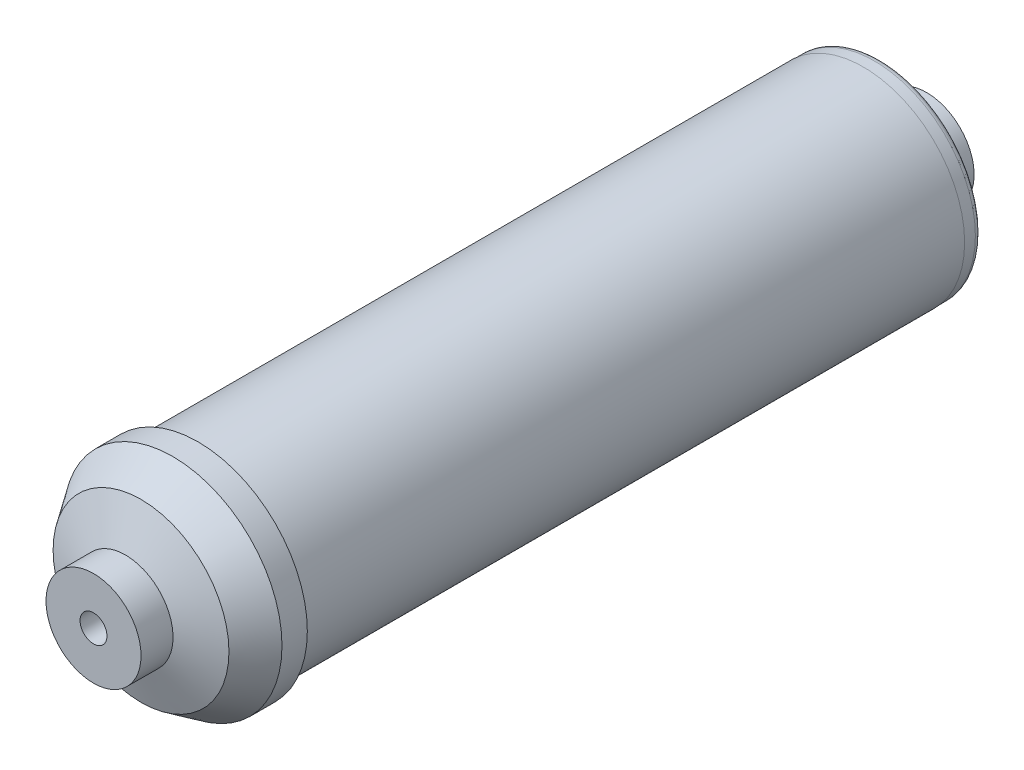
ISO-10303-21;
HEADER;
FILE_DESCRIPTION(('STEP AP214'),'2;1');
FILE_NAME('part.step','',(''),(''),'','','');
FILE_SCHEMA(('AUTOMOTIVE_DESIGN { 1 0 10303 214 1 1 1 1 }'));
ENDSEC;
DATA;
#1=APPLICATION_CONTEXT('core data for automotive mechanical design processes');
#2=APPLICATION_PROTOCOL_DEFINITION('international standard','automotive_design',2000,#1);
#3=PRODUCT_CONTEXT('',#1,'mechanical');
#4=PRODUCT('Part','Part','',(#3));
#5=PRODUCT_RELATED_PRODUCT_CATEGORY('part','',(#4));
#6=PRODUCT_DEFINITION_FORMATION('','',#4);
#7=PRODUCT_DEFINITION_CONTEXT('part definition',#1,'design');
#8=PRODUCT_DEFINITION('design','',#6,#7);
#9=PRODUCT_DEFINITION_SHAPE('','',#8);
#10=(LENGTH_UNIT() NAMED_UNIT(*) SI_UNIT(.MILLI.,.METRE.));
#11=(NAMED_UNIT(*) PLANE_ANGLE_UNIT() SI_UNIT($,.RADIAN.));
#12=(NAMED_UNIT(*) SI_UNIT($,.STERADIAN.) SOLID_ANGLE_UNIT());
#13=UNCERTAINTY_MEASURE_WITH_UNIT(LENGTH_MEASURE(1.E-05),#10,'distance_accuracy_value','');
#14=(GEOMETRIC_REPRESENTATION_CONTEXT(3) GLOBAL_UNCERTAINTY_ASSIGNED_CONTEXT((#13)) GLOBAL_UNIT_ASSIGNED_CONTEXT((#10,
#11,#12)) REPRESENTATION_CONTEXT('',''));
#15=CARTESIAN_POINT('',(0.,0.,0.));
#16=DIRECTION('',(0.,0.,1.));
#17=DIRECTION('',(1.,0.,0.));
#18=AXIS2_PLACEMENT_3D('',#15,#16,#17);
#19=CARTESIAN_POINT('',(0.,0.,0.));
#20=DIRECTION('',(0.,0.,1.));
#21=DIRECTION('',(1.,0.,0.));
#22=AXIS2_PLACEMENT_3D('',#19,#20,#21);
#23=PLANE('',#22);
#24=CARTESIAN_POINT('',(0.,0.,0.));
#25=DIRECTION('',(0.,0.,1.));
#26=DIRECTION('',(1.,0.,0.));
#27=AXIS2_PLACEMENT_3D('',#24,#25,#26);
#28=CIRCLE('',#27,32.);
#29=CARTESIAN_POINT('',(32.,0.,0.));
#30=VERTEX_POINT('',#29);
#31=EDGE_CURVE('E63',#30,#30,#28,.T.);
#32=ORIENTED_EDGE('',*,*,#31,.F.);
#33=EDGE_LOOP('',(#32));
#34=FACE_BOUND('',#33,.T.);
#35=CARTESIAN_POINT('',(0.,0.,0.));
#36=DIRECTION('',(0.,0.,1.));
#37=DIRECTION('',(1.,0.,0.));
#38=AXIS2_PLACEMENT_3D('',#35,#36,#37);
#39=CIRCLE('',#38,31.9);
#40=CARTESIAN_POINT('',(31.9,0.,0.));
#41=VERTEX_POINT('',#40);
#42=EDGE_CURVE('E48',#41,#41,#39,.F.);
#43=ORIENTED_EDGE('',*,*,#42,.F.);
#44=EDGE_LOOP('',(#43));
#45=FACE_BOUND('',#44,.T.);
#46=ADVANCED_FACE('F33',(#34,#45),#23,.F.);
#47=CARTESIAN_POINT('',(0.,0.,210.));
#48=DIRECTION('',(0.,0.,-1.));
#49=DIRECTION('',(-1.,0.,0.));
#50=AXIS2_PLACEMENT_3D('',#47,#48,#49);
#51=CYLINDRICAL_SURFACE('',#50,32.);
#52=CARTESIAN_POINT('',(0.,0.,210.));
#53=DIRECTION('',(0.,0.,1.));
#54=DIRECTION('',(1.,0.,0.));
#55=AXIS2_PLACEMENT_3D('',#52,#53,#54);
#56=CIRCLE('',#55,32.);
#57=CARTESIAN_POINT('',(32.,0.,210.));
#58=VERTEX_POINT('',#57);
#59=EDGE_CURVE('E62',#58,#58,#56,.T.);
#60=ORIENTED_EDGE('',*,*,#59,.F.);
#61=EDGE_LOOP('',(#60));
#62=FACE_BOUND('',#61,.T.);
#63=ORIENTED_EDGE('',*,*,#31,.T.);
#64=EDGE_LOOP('',(#63));
#65=FACE_BOUND('',#64,.T.);
#66=ADVANCED_FACE('F110',(#62,#65),#51,.T.);
#67=CARTESIAN_POINT('',(0.,0.,210.));
#68=DIRECTION('',(0.,0.,1.));
#69=DIRECTION('',(1.,0.,0.));
#70=AXIS2_PLACEMENT_3D('',#67,#68,#69);
#71=PLANE('',#70);
#72=CARTESIAN_POINT('',(0.,0.,210.));
#73=DIRECTION('',(0.,0.,1.));
#74=DIRECTION('',(1.,0.,0.));
#75=AXIS2_PLACEMENT_3D('',#72,#73,#74);
#76=CIRCLE('',#75,34.5);
#77=CARTESIAN_POINT('',(34.5,0.,210.));
#78=VERTEX_POINT('',#77);
#79=EDGE_CURVE('E66',#78,#78,#76,.T.);
#80=ORIENTED_EDGE('',*,*,#79,.F.);
#81=EDGE_LOOP('',(#80));
#82=FACE_BOUND('',#81,.T.);
#83=ORIENTED_EDGE('',*,*,#59,.T.);
#84=EDGE_LOOP('',(#83));
#85=FACE_BOUND('',#84,.T.);
#86=ADVANCED_FACE('F116',(#82,#85),#71,.F.);
#87=CARTESIAN_POINT('',(0.,0.,228.));
#88=DIRECTION('',(0.,0.,-1.));
#89=DIRECTION('',(-1.,0.,0.));
#90=AXIS2_PLACEMENT_3D('',#87,#88,#89);
#91=CYLINDRICAL_SURFACE('',#90,34.5);
#92=CARTESIAN_POINT('',(0.,0.,218.));
#93=DIRECTION('',(0.,0.,1.));
#94=DIRECTION('',(1.,0.,0.));
#95=AXIS2_PLACEMENT_3D('',#92,#93,#94);
#96=CIRCLE('',#95,34.5);
#97=CARTESIAN_POINT('',(34.5,0.,218.));
#98=VERTEX_POINT('',#97);
#99=EDGE_CURVE('E56',#98,#98,#96,.F.);
#100=ORIENTED_EDGE('',*,*,#99,.T.);
#101=EDGE_LOOP('',(#100));
#102=FACE_BOUND('',#101,.T.);
#103=ORIENTED_EDGE('',*,*,#79,.T.);
#104=EDGE_LOOP('',(#103));
#105=FACE_BOUND('',#104,.T.);
#106=ADVANCED_FACE('F122',(#102,#105),#91,.T.);
#107=CARTESIAN_POINT('',(0.,0.,228.));
#108=DIRECTION('',(0.,0.,-1.));
#109=DIRECTION('',(-1.,0.,0.));
#110=AXIS2_PLACEMENT_3D('',#107,#108,#109);
#111=CONICAL_SURFACE('',#110,27.7549148315757,0.593411945678069);
#112=ORIENTED_EDGE('',*,*,#99,.F.);
#113=EDGE_LOOP('',(#112));
#114=FACE_BOUND('',#113,.T.);
#115=CARTESIAN_POINT('',(0.,0.,228.));
#116=DIRECTION('',(0.,0.,1.));
#117=DIRECTION('',(1.,0.,0.));
#118=AXIS2_PLACEMENT_3D('',#115,#116,#117);
#119=CIRCLE('',#118,27.7549148315757);
#120=CARTESIAN_POINT('',(27.7549148315757,0.,228.));
#121=VERTEX_POINT('',#120);
#122=EDGE_CURVE('E59',#121,#121,#119,.T.);
#123=ORIENTED_EDGE('',*,*,#122,.F.);
#124=EDGE_LOOP('',(#123));
#125=FACE_BOUND('',#124,.T.);
#126=ADVANCED_FACE('F125',(#114,#125),#111,.T.);
#127=CARTESIAN_POINT('',(0.,0.,243.));
#128=DIRECTION('',(0.,0.,-1.));
#129=DIRECTION('',(-1.,0.,0.));
#130=AXIS2_PLACEMENT_3D('',#127,#128,#129);
#131=CYLINDRICAL_SURFACE('',#130,15.);
#132=CARTESIAN_POINT('',(0.,0.,232.896153073782));
#133=DIRECTION('',(0.,0.,-1.));
#134=DIRECTION('',(-1.,0.,0.));
#135=AXIS2_PLACEMENT_3D('',#132,#133,#134);
#136=CIRCLE('',#135,15.);
#137=CARTESIAN_POINT('',(-15.,0.,232.896153073782));
#138=VERTEX_POINT('',#137);
#139=EDGE_CURVE('E53',#138,#138,#136,.F.);
#140=ORIENTED_EDGE('',*,*,#139,.T.);
#141=EDGE_LOOP('',(#140));
#142=FACE_BOUND('',#141,.T.);
#143=CARTESIAN_POINT('',(0.,0.,243.));
#144=DIRECTION('',(0.,0.,1.));
#145=DIRECTION('',(1.,0.,0.));
#146=AXIS2_PLACEMENT_3D('',#143,#144,#145);
#147=CIRCLE('',#146,15.);
#148=CARTESIAN_POINT('',(15.,0.,243.));
#149=VERTEX_POINT('',#148);
#150=EDGE_CURVE('E71',#149,#149,#147,.T.);
#151=ORIENTED_EDGE('',*,*,#150,.F.);
#152=EDGE_LOOP('',(#151));
#153=FACE_BOUND('',#152,.T.);
#154=ADVANCED_FACE('F128',(#142,#153),#131,.T.);
#155=CARTESIAN_POINT('',(0.,0.,243.));
#156=DIRECTION('',(0.,0.,1.));
#157=DIRECTION('',(1.,0.,0.));
#158=AXIS2_PLACEMENT_3D('',#155,#156,#157);
#159=PLANE('',#158);
#160=CARTESIAN_POINT('',(0.,0.,243.));
#161=DIRECTION('',(0.,0.,1.));
#162=DIRECTION('',(1.,0.,0.));
#163=AXIS2_PLACEMENT_3D('',#160,#161,#162);
#164=CIRCLE('',#163,4.25);
#165=CARTESIAN_POINT('',(4.25,0.,243.));
#166=VERTEX_POINT('',#165);
#167=EDGE_CURVE('E74',#166,#166,#164,.T.);
#168=ORIENTED_EDGE('',*,*,#167,.F.);
#169=EDGE_LOOP('',(#168));
#170=FACE_BOUND('',#169,.T.);
#171=ORIENTED_EDGE('',*,*,#150,.T.);
#172=EDGE_LOOP('',(#171));
#173=FACE_BOUND('',#172,.T.);
#174=ADVANCED_FACE('F149',(#170,#173),#159,.T.);
#175=CARTESIAN_POINT('',(0.,0.,-611.));
#176=DIRECTION('',(0.,0.,1.));
#177=DIRECTION('',(1.,0.,0.));
#178=AXIS2_PLACEMENT_3D('',#175,#176,#177);
#179=CYLINDRICAL_SURFACE('',#178,4.25);
#180=ORIENTED_EDGE('',*,*,#167,.T.);
#181=EDGE_LOOP('',(#180));
#182=FACE_BOUND('',#181,.T.);
#183=CARTESIAN_POINT('',(0.,0.,-20.));
#184=DIRECTION('',(0.,0.,-1.));
#185=DIRECTION('',(-1.,0.,0.));
#186=AXIS2_PLACEMENT_3D('',#183,#184,#185);
#187=CIRCLE('',#186,4.25);
#188=CARTESIAN_POINT('',(-4.25,0.,-20.));
#189=VERTEX_POINT('',#188);
#190=EDGE_CURVE('E81',#189,#189,#187,.T.);
#191=ORIENTED_EDGE('',*,*,#190,.T.);
#192=EDGE_LOOP('',(#191));
#193=FACE_BOUND('',#192,.T.);
#194=ADVANCED_FACE('F87',(#182,#193),#179,.F.);
#195=CARTESIAN_POINT('',(0.,0.,233.));
#196=DIRECTION('',(0.,0.,-1.));
#197=DIRECTION('',(-1.,0.,0.));
#198=AXIS2_PLACEMENT_3D('',#195,#196,#197);
#199=CONICAL_SURFACE('',#198,14.7294695081063,1.20427718387609);
#200=ORIENTED_EDGE('',*,*,#122,.T.);
#201=EDGE_LOOP('',(#200));
#202=FACE_BOUND('',#201,.T.);
#203=ORIENTED_EDGE('',*,*,#139,.F.);
#204=EDGE_LOOP('',(#203));
#205=FACE_BOUND('',#204,.T.);
#206=ADVANCED_FACE('F130',(#202,#205),#199,.T.);
#207=CARTESIAN_POINT('',(0.,0.,-10.));
#208=DIRECTION('',(0.,0.,1.));
#209=DIRECTION('',(1.,0.,0.));
#210=AXIS2_PLACEMENT_3D('',#207,#208,#209);
#211=CYLINDRICAL_SURFACE('',#210,31.9);
#212=CARTESIAN_POINT('',(0.,0.,-3.49289189979442));
#213=DIRECTION('',(0.,0.,-1.));
#214=DIRECTION('',(-1.,0.,0.));
#215=AXIS2_PLACEMENT_3D('',#212,#213,#214);
#216=CIRCLE('',#215,31.9);
#217=CARTESIAN_POINT('',(-31.9,0.,-3.49289189979442));
#218=VERTEX_POINT('',#217);
#219=EDGE_CURVE('E40',#218,#218,#216,.F.);
#220=ORIENTED_EDGE('',*,*,#219,.T.);
#221=EDGE_LOOP('',(#220));
#222=FACE_BOUND('',#221,.T.);
#223=ORIENTED_EDGE('',*,*,#42,.T.);
#224=EDGE_LOOP('',(#223));
#225=FACE_BOUND('',#224,.T.);
#226=ADVANCED_FACE('F132',(#222,#225),#211,.T.);
#227=CARTESIAN_POINT('',(0.,0.,-10.));
#228=DIRECTION('',(0.,0.,1.));
#229=DIRECTION('',(1.,0.,0.));
#230=AXIS2_PLACEMENT_3D('',#227,#228,#229);
#231=CONICAL_SURFACE('',#230,14.4629277807956,1.2915436464758);
#232=CARTESIAN_POINT('',(0.,0.,-5.41541529167105));
#233=DIRECTION('',(0.,0.,1.));
#234=DIRECTION('',(1.,0.,0.));
#235=AXIS2_PLACEMENT_3D('',#232,#233,#234);
#236=CIRCLE('',#235,30.451274711634);
#237=CARTESIAN_POINT('',(30.451274711634,0.,-5.41541529167105));
#238=VERTEX_POINT('',#237);
#239=EDGE_CURVE('E10',#238,#238,#236,.F.);
#240=ORIENTED_EDGE('',*,*,#239,.T.);
#241=EDGE_LOOP('',(#240));
#242=FACE_BOUND('',#241,.T.);
#243=CARTESIAN_POINT('',(0.,0.,-10.));
#244=DIRECTION('',(0.,0.,-1.));
#245=DIRECTION('',(-1.,0.,0.));
#246=AXIS2_PLACEMENT_3D('',#243,#244,#245);
#247=CIRCLE('',#246,14.4629277807956);
#248=CARTESIAN_POINT('',(-14.4629277807956,0.,-10.));
#249=VERTEX_POINT('',#248);
#250=EDGE_CURVE('E44',#249,#249,#247,.T.);
#251=ORIENTED_EDGE('',*,*,#250,.F.);
#252=EDGE_LOOP('',(#251));
#253=FACE_BOUND('',#252,.T.);
#254=ADVANCED_FACE('F134',(#242,#253),#231,.T.);
#255=CARTESIAN_POINT('',(0.,0.,-3.49289189979442));
#256=DIRECTION('',(0.,0.,-1.));
#257=DIRECTION('',(-1.,0.,0.));
#258=AXIS2_PLACEMENT_3D('',#255,#256,#257);
#259=TOROIDAL_SURFACE('',#258,29.9,2.);
#260=ORIENTED_EDGE('',*,*,#239,.F.);
#261=EDGE_LOOP('',(#260));
#262=FACE_BOUND('',#261,.T.);
#263=ORIENTED_EDGE('',*,*,#219,.F.);
#264=EDGE_LOOP('',(#263));
#265=FACE_BOUND('',#264,.T.);
#266=ADVANCED_FACE('F35',(#262,#265),#259,.T.);
#267=CARTESIAN_POINT('',(0.,0.,-20.));
#268=DIRECTION('',(0.,0.,1.));
#269=DIRECTION('',(1.,0.,0.));
#270=AXIS2_PLACEMENT_3D('',#267,#268,#269);
#271=CYLINDRICAL_SURFACE('',#270,15.);
#272=CARTESIAN_POINT('',(0.,0.,-20.));
#273=DIRECTION('',(0.,0.,-1.));
#274=DIRECTION('',(-1.,0.,0.));
#275=AXIS2_PLACEMENT_3D('',#272,#273,#274);
#276=CIRCLE('',#275,15.);
#277=CARTESIAN_POINT('',(-15.,0.,-20.));
#278=VERTEX_POINT('',#277);
#279=EDGE_CURVE('E77',#278,#278,#276,.T.);
#280=ORIENTED_EDGE('',*,*,#279,.F.);
#281=EDGE_LOOP('',(#280));
#282=FACE_BOUND('',#281,.T.);
#283=CARTESIAN_POINT('',(0.,0.,-10.));
#284=DIRECTION('',(0.,0.,-1.));
#285=DIRECTION('',(-1.,0.,0.));
#286=AXIS2_PLACEMENT_3D('',#283,#284,#285);
#287=CIRCLE('',#286,15.);
#288=CARTESIAN_POINT('',(-15.,0.,-10.));
#289=VERTEX_POINT('',#288);
#290=EDGE_CURVE('E78',#289,#289,#287,.T.);
#291=ORIENTED_EDGE('',*,*,#290,.T.);
#292=EDGE_LOOP('',(#291));
#293=FACE_BOUND('',#292,.T.);
#294=ADVANCED_FACE('F93',(#282,#293),#271,.T.);
#295=CARTESIAN_POINT('',(0.,0.,-20.));
#296=DIRECTION('',(0.,0.,-1.));
#297=DIRECTION('',(-1.,0.,0.));
#298=AXIS2_PLACEMENT_3D('',#295,#296,#297);
#299=PLANE('',#298);
#300=ORIENTED_EDGE('',*,*,#190,.F.);
#301=EDGE_LOOP('',(#300));
#302=FACE_BOUND('',#301,.T.);
#303=ORIENTED_EDGE('',*,*,#279,.T.);
#304=EDGE_LOOP('',(#303));
#305=FACE_BOUND('',#304,.T.);
#306=ADVANCED_FACE('F89',(#302,#305),#299,.T.);
#307=CARTESIAN_POINT('',(0.,0.,-10.));
#308=DIRECTION('',(0.,0.,-1.));
#309=DIRECTION('',(-1.,0.,0.));
#310=AXIS2_PLACEMENT_3D('',#307,#308,#309);
#311=PLANE('',#310);
#312=ORIENTED_EDGE('',*,*,#250,.T.);
#313=EDGE_LOOP('',(#312));
#314=FACE_BOUND('',#313,.T.);
#315=ORIENTED_EDGE('',*,*,#290,.F.);
#316=EDGE_LOOP('',(#315));
#317=FACE_BOUND('',#316,.T.);
#318=ADVANCED_FACE('F92',(#314,#317),#311,.F.);
#319=CLOSED_SHELL('',(#46,#66,#86,#106,#126,#154,#174,#194,#206,#226,#254,#266,#294,#306,#318));
#320=MANIFOLD_SOLID_BREP('B2',#319);
#321=ADVANCED_BREP_SHAPE_REPRESENTATION('',(#18,#320),#14);
#322=SHAPE_DEFINITION_REPRESENTATION(#9,#321);
ENDSEC;
END-ISO-10303-21;
